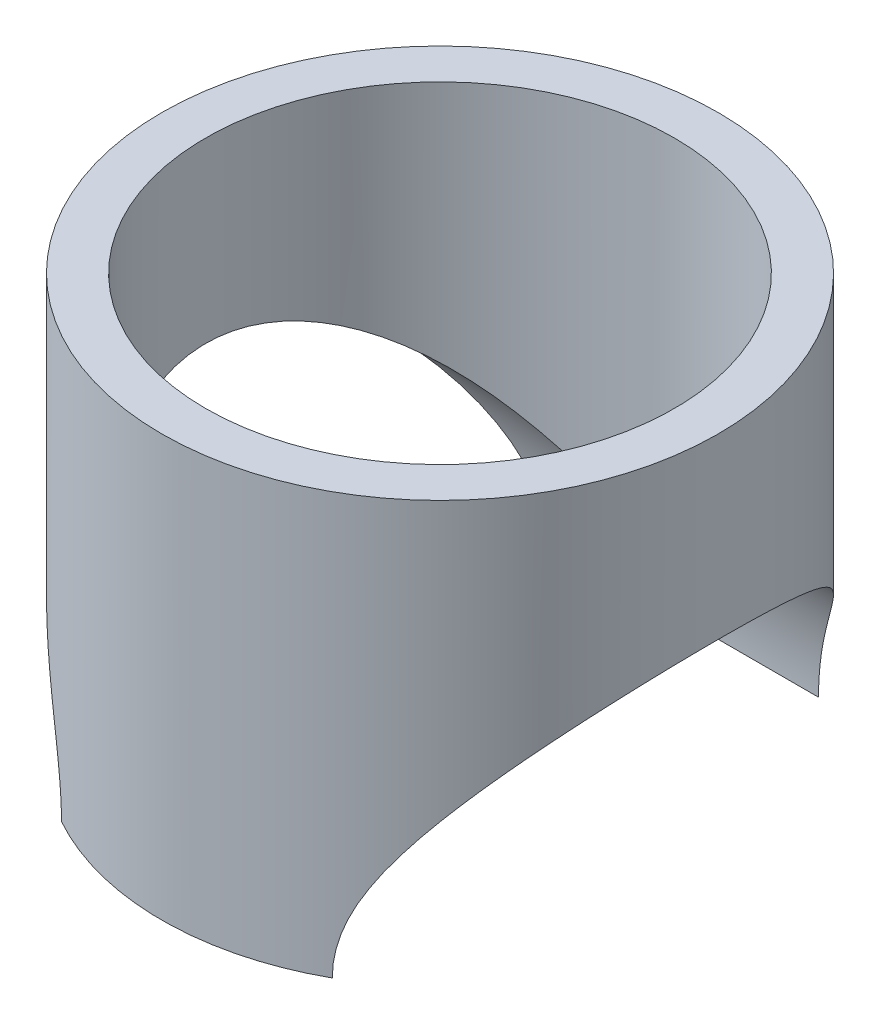
ISO-10303-21;
HEADER;
FILE_DESCRIPTION(('STEP AP214'),'2;1');
FILE_NAME('part.step','',(''),(''),'','','');
FILE_SCHEMA(('AUTOMOTIVE_DESIGN { 1 0 10303 214 1 1 1 1 }'));
ENDSEC;
DATA;
#1=APPLICATION_CONTEXT('core data for automotive mechanical design processes');
#2=APPLICATION_PROTOCOL_DEFINITION('international standard','automotive_design',2000,#1);
#3=PRODUCT_CONTEXT('',#1,'mechanical');
#4=PRODUCT('Part','Part','',(#3));
#5=PRODUCT_RELATED_PRODUCT_CATEGORY('part','',(#4));
#6=PRODUCT_DEFINITION_FORMATION('','',#4);
#7=PRODUCT_DEFINITION_CONTEXT('part definition',#1,'design');
#8=PRODUCT_DEFINITION('design','',#6,#7);
#9=PRODUCT_DEFINITION_SHAPE('','',#8);
#10=(LENGTH_UNIT() NAMED_UNIT(*) SI_UNIT(.MILLI.,.METRE.));
#11=(NAMED_UNIT(*) PLANE_ANGLE_UNIT() SI_UNIT($,.RADIAN.));
#12=(NAMED_UNIT(*) SI_UNIT($,.STERADIAN.) SOLID_ANGLE_UNIT());
#13=UNCERTAINTY_MEASURE_WITH_UNIT(LENGTH_MEASURE(1.E-05),#10,'distance_accuracy_value','');
#14=(GEOMETRIC_REPRESENTATION_CONTEXT(3) GLOBAL_UNCERTAINTY_ASSIGNED_CONTEXT((#13)) GLOBAL_UNIT_ASSIGNED_CONTEXT((#10,
#11,#12)) REPRESENTATION_CONTEXT('',''));
#15=CARTESIAN_POINT('',(0.,0.,0.));
#16=DIRECTION('',(0.,0.,1.));
#17=DIRECTION('',(1.,0.,0.));
#18=AXIS2_PLACEMENT_3D('',#15,#16,#17);
#19=CARTESIAN_POINT('',(0.,-18.25625,0.));
#20=DIRECTION('',(0.,1.,0.));
#21=DIRECTION('',(0.,0.,1.));
#22=AXIS2_PLACEMENT_3D('',#19,#20,#21);
#23=PLANE('',#22);
#24=CARTESIAN_POINT('',(0.,-18.25625,0.));
#25=DIRECTION('',(0.,1.,0.));
#26=DIRECTION('',(0.,0.,1.));
#27=AXIS2_PLACEMENT_3D('',#24,#25,#26);
#28=CIRCLE('',#27,24.13);
#29=CARTESIAN_POINT('',(11.739087528424,-18.25625,-21.082));
#30=VERTEX_POINT('',#29);
#31=CARTESIAN_POINT('',(-11.739087528424,-18.25625,-21.082));
#32=VERTEX_POINT('',#31);
#33=EDGE_CURVE('E55',#30,#32,#28,.T.);
#34=ORIENTED_EDGE('',*,*,#33,.F.);
#35=DIRECTION('',(1.,0.,0.));
#36=VECTOR('',#35,1.);
#37=CARTESIAN_POINT('',(0.,-18.25625,-21.082));
#38=LINE('',#37,#36);
#39=EDGE_CURVE('E68',#30,#32,#38,.F.);
#40=ORIENTED_EDGE('',*,*,#39,.T.);
#41=EDGE_LOOP('',(#34,#40));
#42=FACE_BOUND('',#41,.T.);
#43=ADVANCED_FACE('F34',(#42),#23,.F.);
#44=CARTESIAN_POINT('',(0.,18.25625,0.));
#45=DIRECTION('',(0.,1.,0.));
#46=DIRECTION('',(0.,0.,1.));
#47=AXIS2_PLACEMENT_3D('',#44,#45,#46);
#48=PLANE('',#47);
#49=CARTESIAN_POINT('',(0.,18.25625,0.));
#50=DIRECTION('',(0.,1.,0.));
#51=DIRECTION('',(0.,0.,1.));
#52=AXIS2_PLACEMENT_3D('',#49,#50,#51);
#53=CIRCLE('',#52,24.13);
#54=CARTESIAN_POINT('',(0.,18.25625,24.13));
#55=VERTEX_POINT('',#54);
#56=EDGE_CURVE('E48',#55,#55,#53,.T.);
#57=ORIENTED_EDGE('',*,*,#56,.T.);
#58=EDGE_LOOP('',(#57));
#59=FACE_BOUND('',#58,.T.);
#60=CARTESIAN_POINT('',(0.,18.25625,0.));
#61=DIRECTION('',(0.,1.,0.));
#62=DIRECTION('',(0.,0.,1.));
#63=AXIS2_PLACEMENT_3D('',#60,#61,#62);
#64=CIRCLE('',#63,20.32);
#65=CARTESIAN_POINT('',(0.,18.25625,20.32));
#66=VERTEX_POINT('',#65);
#67=EDGE_CURVE('E79',#66,#66,#64,.T.);
#68=ORIENTED_EDGE('',*,*,#67,.F.);
#69=EDGE_LOOP('',(#68));
#70=FACE_BOUND('',#69,.T.);
#71=ADVANCED_FACE('F104',(#59,#70),#48,.T.);
#72=DIRECTION('',(1.,0.,0.));
#73=VECTOR('',#72,1.);
#74=CARTESIAN_POINT('',(0.,-18.25625,21.082));
#75=LINE('',#74,#73);
#76=CARTESIAN_POINT('',(-11.739087528424,-18.25625,21.082));
#77=VERTEX_POINT('',#76);
#78=CARTESIAN_POINT('',(11.739087528424,-18.25625,21.082));
#79=VERTEX_POINT('',#78);
#80=EDGE_CURVE('E62',#77,#79,#75,.T.);
#81=ORIENTED_EDGE('',*,*,#80,.T.);
#82=EDGE_CURVE('E77',#77,#79,#28,.T.);
#83=ORIENTED_EDGE('',*,*,#82,.F.);
#84=EDGE_LOOP('',(#81,#83));
#85=FACE_BOUND('',#84,.T.);
#86=ADVANCED_FACE('F106',(#85),#23,.F.);
#87=CARTESIAN_POINT('',(0.,18.25625,0.));
#88=DIRECTION('',(0.,-1.,0.));
#89=DIRECTION('',(0.,0.,-1.));
#90=AXIS2_PLACEMENT_3D('',#87,#88,#89);
#91=CYLINDRICAL_SURFACE('',#90,24.13);
#92=ORIENTED_EDGE('',*,*,#56,.F.);
#93=EDGE_LOOP('',(#92));
#94=FACE_BOUND('',#93,.T.);
#95=ORIENTED_EDGE('',*,*,#82,.T.);
#96=CARTESIAN_POINT('',(11.739087528424,-18.25625,21.082));
#97=CARTESIAN_POINT('',(11.7390735991911,-18.08407407303,21.0820033956179));
#98=CARTESIAN_POINT('',(11.7428775245086,-17.9119284080734,21.0798900670036));
#99=CARTESIAN_POINT('',(11.7579884747208,-17.5680994761874,21.0714669377096));
#100=CARTESIAN_POINT('',(11.7692941595323,-17.3964161321697,21.0651578865359));
#101=CARTESIAN_POINT('',(11.8141910028188,-16.8834391279661,21.040034025855));
#102=CARTESIAN_POINT('',(11.8587633128905,-16.543341097433,21.0150221015338));
#103=CARTESIAN_POINT('',(11.9737048677594,-15.8750339752899,20.9497376890227));
#104=CARTESIAN_POINT('',(12.0436335160157,-15.5467212428461,20.909725468668));
#105=CARTESIAN_POINT('',(12.2060359880762,-14.8976845627344,20.8153404861012));
#106=CARTESIAN_POINT('',(12.2985245072683,-14.5769657116835,20.7609583614737));
#107=CARTESIAN_POINT('',(12.5484251271962,-13.8013732186979,20.6112485337628));
#108=CARTESIAN_POINT('',(12.7162968837642,-13.3513025005434,20.5085195345175));
#109=CARTESIAN_POINT('',(13.0814490845255,-12.4701267720358,20.2775553309992));
#110=CARTESIAN_POINT('',(13.2787435684613,-12.039030943883,20.14930794021));
#111=CARTESIAN_POINT('',(13.6961533726555,-11.1911359828143,19.8679700881986));
#112=CARTESIAN_POINT('',(13.9164644077948,-10.7745077303363,19.714659039238));
#113=CARTESIAN_POINT('',(14.3715808518282,-9.95861330201741,19.3853933315258));
#114=CARTESIAN_POINT('',(14.6063854155648,-9.55934611611482,19.2094399924607));
#115=CARTESIAN_POINT('',(15.0351878436054,-8.85888917974106,18.8747921840822));
#116=CARTESIAN_POINT('',(15.2274436243599,-8.55465866664908,18.7201903507985));
#117=CARTESIAN_POINT('',(15.615749993839,-7.95589421440815,18.3975278906171));
#118=CARTESIAN_POINT('',(15.8118009645401,-7.66136125943689,18.2294659035912));
#119=CARTESIAN_POINT('',(16.4031186599564,-6.79162031883522,17.7051357024082));
#120=CARTESIAN_POINT('',(16.8014559261532,-6.23042092901618,17.3287955231726));
#121=CARTESIAN_POINT('',(17.5935759198042,-5.14657597181105,16.5239648376673));
#122=CARTESIAN_POINT('',(17.9873679374965,-4.62383191492748,16.0956155727483));
#123=CARTESIAN_POINT('',(18.7620280565222,-3.61689060282745,15.1855208236601));
#124=CARTESIAN_POINT('',(19.142901838275,-3.13267627581971,14.7037992166734));
#125=CARTESIAN_POINT('',(19.7979937394125,-2.31259208230997,13.8033060115728));
#126=CARTESIAN_POINT('',(20.0766187768359,-1.96819152161001,13.3954826047861));
#127=CARTESIAN_POINT('',(20.6170322702882,-1.30655085934945,12.5478087141213));
#128=CARTESIAN_POINT('',(20.8788211700136,-0.989310041952961,12.1079590749085));
#129=CARTESIAN_POINT('',(21.3811440106904,-0.385177021028827,11.1970391769103));
#130=CARTESIAN_POINT('',(21.6217005084017,-0.0982525447157852,10.7260030044625));
#131=CARTESIAN_POINT('',(21.9634627085038,0.306959834283379,9.99676525436779));
#132=CARTESIAN_POINT('',(22.074200527265,0.437830046209029,9.7499160274075));
#133=CARTESIAN_POINT('',(22.2888283168124,0.690786093225204,9.24874897262869));
#134=CARTESIAN_POINT('',(22.3927165090234,0.812869647518544,8.99442922960148));
#135=CARTESIAN_POINT('',(22.6557598724382,1.12124272779861,8.31719373048579));
#136=CARTESIAN_POINT('',(22.8088160044349,1.29990149644173,7.88836839092437));
#137=CARTESIAN_POINT('',(23.0928338791217,1.63042748467382,7.01351531469732));
#138=CARTESIAN_POINT('',(23.2238001390804,1.78230018217138,6.56749111808858));
#139=CARTESIAN_POINT('',(23.4613695200211,2.05715593136349,5.66044959105592));
#140=CARTESIAN_POINT('',(23.5679822167315,2.1801503384237,5.19943823525703));
#141=CARTESIAN_POINT('',(23.7548637062547,2.39538979797867,4.26501387511208));
#142=CARTESIAN_POINT('',(23.8351322079308,2.48763451065056,3.791600733773));
#143=CARTESIAN_POINT('',(23.9680076717743,2.64017622817548,2.83315766499687));
#144=CARTESIAN_POINT('',(24.0204651423892,2.70030059076089,2.34807932105807));
#145=CARTESIAN_POINT('',(24.0958936412044,2.78671462776825,1.37262187745551));
#146=CARTESIAN_POINT('',(24.1188646023565,2.81300422525463,0.882242765741078));
#147=CARTESIAN_POINT('',(24.1347883831059,2.83123097137466,-0.0995719725427617));
#148=CARTESIAN_POINT('',(24.1277454676267,2.82317300074236,-0.59100743908707));
#149=CARTESIAN_POINT('',(24.0838129836678,2.77287321380192,-1.57075843632448));
#150=CARTESIAN_POINT('',(24.046924979396,2.730633189006,-2.05907412917589));
#151=CARTESIAN_POINT('',(23.9485083643139,2.61779042171497,-2.98747550538334));
#152=CARTESIAN_POINT('',(23.8893296033681,2.54989091094967,-3.42814511096225));
#153=CARTESIAN_POINT('',(23.7477698443778,2.38719943436388,-4.30065532684726));
#154=CARTESIAN_POINT('',(23.6653904470208,2.29240932381025,-4.73249654404878));
#155=CARTESIAN_POINT('',(23.4788321311074,2.07727528630051,-5.58495844876746));
#156=CARTESIAN_POINT('',(23.3746515218667,1.95692937748145,-6.00557826321081));
#157=CARTESIAN_POINT('',(23.1461387876345,1.69223427108215,-6.83356769686585));
#158=CARTESIAN_POINT('',(23.0218054185968,1.54788359165367,-7.24093649621643));
#159=CARTESIAN_POINT('',(22.7456021652489,1.2261398431218,-8.0683039057928));
#160=CARTESIAN_POINT('',(22.5924274017339,1.04715813372704,-8.48724779671844));
#161=CARTESIAN_POINT('',(22.2673789975177,0.665693744031697,-9.30672224437815));
#162=CARTESIAN_POINT('',(22.0955050238618,0.463210645265515,-9.70725247306132));
#163=CARTESIAN_POINT('',(21.7352637750987,0.0366060825356913,-10.4890666599843));
#164=CARTESIAN_POINT('',(21.5468908942153,-0.187522738595435,-10.8703440068291));
#165=CARTESIAN_POINT('',(21.1559090574181,-0.655600764159128,-11.6129492644716));
#166=CARTESIAN_POINT('',(20.9532971606271,-0.899554064707212,-11.9742730264431));
#167=CARTESIAN_POINT('',(20.4283285028445,-1.53627061071713,-12.857822369502));
#168=CARTESIAN_POINT('',(20.0981131136747,-1.94088524276709,-13.3669087963575));
#169=CARTESIAN_POINT('',(19.4171168179919,-2.78751979392966,-14.3382207585271));
#170=CARTESIAN_POINT('',(19.0663264434196,-3.22955697604914,-14.8004244483688));
#171=CARTESIAN_POINT('',(18.3504579632687,-4.14892420714467,-15.6792711924517));
#172=CARTESIAN_POINT('',(17.9853453799674,-4.62634223806346,-16.0957938142865));
#173=CARTESIAN_POINT('',(17.2492225520943,-5.6135470593565,-16.882271969802));
#174=CARTESIAN_POINT('',(16.878213912849,-6.1233251484868,-17.2522399423612));
#175=CARTESIAN_POINT('',(16.1928125714475,-7.0981656749566,-17.8951682454679));
#176=CARTESIAN_POINT('',(15.878076524012,-7.55886167034416,-18.1744024144448));
#177=CARTESIAN_POINT('',(15.256825362399,-8.5047407678277,-18.698968527221));
#178=CARTESIAN_POINT('',(14.9503124668056,-8.98993037848372,-18.944291394521));
#179=CARTESIAN_POINT('',(14.3546359423477,-9.98531509123404,-19.3995164604927));
#180=CARTESIAN_POINT('',(14.065432574079,-10.495447614902,-19.6095019682124));
#181=CARTESIAN_POINT('',(13.6529179816347,-11.2816261140679,-19.8968072202025));
#182=CARTESIAN_POINT('',(13.5190022183166,-11.5470911566672,-19.9879379518083));
#183=CARTESIAN_POINT('',(13.2600944866233,-12.0853732702324,-20.1606308855133));
#184=CARTESIAN_POINT('',(13.1351041264938,-12.3581916540404,-20.2421913648677));
#185=CARTESIAN_POINT('',(12.747458743117,-13.2557469080203,-20.490487427798));
#186=CARTESIAN_POINT('',(12.5067493342205,-13.8965014440883,-20.6371170384919));
#187=CARTESIAN_POINT('',(12.2101050282709,-14.8830900866602,-20.8130643312883));
#188=CARTESIAN_POINT('',(12.1220620285236,-15.2155691231136,-20.8643271503547));
#189=CARTESIAN_POINT('',(11.9710882109104,-15.888124681314,-20.9513124087923));
#190=CARTESIAN_POINT('',(11.9081413380531,-16.2281961983066,-20.9870447849298));
#191=CARTESIAN_POINT('',(11.8199438741503,-16.8489697363104,-21.0368249538532));
#192=CARTESIAN_POINT('',(11.7898196611475,-17.1287570685328,-21.0536932955336));
#193=CARTESIAN_POINT('',(11.7492929221813,-17.6910754620512,-21.0763171033168));
#194=CARTESIAN_POINT('',(11.7389525984072,-17.9736123790282,-21.0820375204629));
#195=CARTESIAN_POINT('',(11.739087528424,-18.25625,-21.082));
#196=B_SPLINE_CURVE_WITH_KNOTS('',3,(#96,#97,#98,#99,#100,#101,#102,#103,#104,#105,#106,#107,
#108,#109,#110,#111,#112,#113,#114,#115,#116,#117,#118,#119,#120,#121,#122,#123,#124,#125,#126,
#127,#128,#129,#130,#131,#132,#133,#134,#135,#136,#137,#138,#139,#140,#141,#142,#143,#144,#145,
#146,#147,#148,#149,#150,#151,#152,#153,#154,#155,#156,#157,#158,#159,#160,#161,#162,#163,#164,
#165,#166,#167,#168,#169,#170,#171,#172,#173,#174,#175,#176,#177,#178,#179,#180,#181,#182,#183,
#184,#185,#186,#187,#188,#189,#190,#191,#192,#193,#194,#195),.UNSPECIFIED.,.F.,.F.,(4,2,2,2,2,2,
2,2,2,2,2,2,2,2,2,2,2,2,2,2,2,2,2,2,2,2,2,2,2,2,2,2,2,2,2,2,2,2,2,2,2,2,2,2,2,2,2,2,2,4),(0.,
0.516414774766779,1.03273732417139,2.06276206676861,3.07568518591108,4.08926988849761,
5.56045256298501,7.03233950631079,8.51795690508985,10.0034877551208,11.1781755276448,
12.3529821507218,14.7031691082531,17.0471107031818,19.390007891152,21.1948722669283,
22.9996890581353,24.802564780825,25.7039285991681,26.6055255514872,28.071339885437,
29.5368541032964,31.0017910908485,32.4667442672644,33.9394940960529,35.4122472736656,
36.8847911824043,38.3572579187905,39.7050947911592,41.0528386946392,42.4006871544234,
43.7486188496975,45.1891451440145,46.6296970922703,48.0707404047464,49.5120822250155,
51.6968835037557,53.8826981801523,56.0741435666265,58.2650021746245,60.1353967072175,
62.0062908932544,63.8727106398916,64.8053050988661,65.7380671778323,67.829964425309,
68.8721351756851,69.9136381339799,70.7584804344512,71.6059746520517),.UNSPECIFIED.);
#197=EDGE_CURVE('E71',#79,#30,#196,.T.);
#198=ORIENTED_EDGE('',*,*,#197,.T.);
#199=ORIENTED_EDGE('',*,*,#33,.T.);
#200=CARTESIAN_POINT('',(-11.739087528424,-18.25625,-21.082));
#201=CARTESIAN_POINT('',(-11.7390735991911,-18.08407407303,-21.0820033956179));
#202=CARTESIAN_POINT('',(-11.7428775245086,-17.9119284080734,-21.0798900670036));
#203=CARTESIAN_POINT('',(-11.7579884747208,-17.5680994761874,-21.0714669377096));
#204=CARTESIAN_POINT('',(-11.7692941595323,-17.3964161321697,-21.0651578865359));
#205=CARTESIAN_POINT('',(-11.8141910028188,-16.8834391279661,-21.040034025855));
#206=CARTESIAN_POINT('',(-11.8587633128905,-16.543341097433,-21.0150221015338));
#207=CARTESIAN_POINT('',(-11.9737048677594,-15.8750339752899,-20.9497376890227));
#208=CARTESIAN_POINT('',(-12.0436335160157,-15.5467212428461,-20.909725468668));
#209=CARTESIAN_POINT('',(-12.2060359880762,-14.8976845627344,-20.8153404861012));
#210=CARTESIAN_POINT('',(-12.2985245072683,-14.5769657116835,-20.7609583614737));
#211=CARTESIAN_POINT('',(-12.5484251271962,-13.8013732186979,-20.6112485337628));
#212=CARTESIAN_POINT('',(-12.7162968837642,-13.3513025005434,-20.5085195345175));
#213=CARTESIAN_POINT('',(-13.0814490845255,-12.4701267720358,-20.2775553309992));
#214=CARTESIAN_POINT('',(-13.2787435684613,-12.039030943883,-20.14930794021));
#215=CARTESIAN_POINT('',(-13.6961533726555,-11.1911359828143,-19.8679700881986));
#216=CARTESIAN_POINT('',(-13.9164644077948,-10.7745077303363,-19.714659039238));
#217=CARTESIAN_POINT('',(-14.3715808518282,-9.95861330201741,-19.3853933315258));
#218=CARTESIAN_POINT('',(-14.6063854155648,-9.55934611611482,-19.2094399924607));
#219=CARTESIAN_POINT('',(-15.0351878436054,-8.85888917974106,-18.8747921840822));
#220=CARTESIAN_POINT('',(-15.2274436243599,-8.55465866664908,-18.7201903507985));
#221=CARTESIAN_POINT('',(-15.615749993839,-7.95589421440815,-18.3975278906171));
#222=CARTESIAN_POINT('',(-15.8118009645401,-7.66136125943689,-18.2294659035912));
#223=CARTESIAN_POINT('',(-16.4031186599564,-6.79162031883522,-17.7051357024082));
#224=CARTESIAN_POINT('',(-16.8014559261532,-6.23042092901618,-17.3287955231726));
#225=CARTESIAN_POINT('',(-17.5935759198042,-5.14657597181105,-16.5239648376673));
#226=CARTESIAN_POINT('',(-17.9873679374965,-4.62383191492748,-16.0956155727483));
#227=CARTESIAN_POINT('',(-18.7620280565222,-3.61689060282745,-15.1855208236601));
#228=CARTESIAN_POINT('',(-19.142901838275,-3.13267627581971,-14.7037992166734));
#229=CARTESIAN_POINT('',(-19.7979937394125,-2.31259208230997,-13.8033060115728));
#230=CARTESIAN_POINT('',(-20.0766187768359,-1.96819152161001,-13.3954826047861));
#231=CARTESIAN_POINT('',(-20.6170322702882,-1.30655085934945,-12.5478087141213));
#232=CARTESIAN_POINT('',(-20.8788211700136,-0.989310041952961,-12.1079590749085));
#233=CARTESIAN_POINT('',(-21.3811440106904,-0.385177021028827,-11.1970391769103));
#234=CARTESIAN_POINT('',(-21.6217005084017,-0.0982525447157852,-10.7260030044625));
#235=CARTESIAN_POINT('',(-21.9634627085038,0.306959834283379,-9.99676525436779));
#236=CARTESIAN_POINT('',(-22.074200527265,0.437830046209029,-9.7499160274075));
#237=CARTESIAN_POINT('',(-22.2888283168124,0.690786093225204,-9.24874897262869));
#238=CARTESIAN_POINT('',(-22.3927165090234,0.812869647518544,-8.99442922960148));
#239=CARTESIAN_POINT('',(-22.6557598724382,1.12124272779861,-8.31719373048579));
#240=CARTESIAN_POINT('',(-22.8088160044349,1.29990149644173,-7.88836839092437));
#241=CARTESIAN_POINT('',(-23.0928338791217,1.63042748467382,-7.01351531469732));
#242=CARTESIAN_POINT('',(-23.2238001390804,1.78230018217138,-6.56749111808858));
#243=CARTESIAN_POINT('',(-23.4613695200211,2.05715593136349,-5.66044959105592));
#244=CARTESIAN_POINT('',(-23.5679822167315,2.1801503384237,-5.19943823525703));
#245=CARTESIAN_POINT('',(-23.7548637062547,2.39538979797867,-4.26501387511208));
#246=CARTESIAN_POINT('',(-23.8351322079308,2.48763451065056,-3.791600733773));
#247=CARTESIAN_POINT('',(-23.9680076717743,2.64017622817548,-2.83315766499687));
#248=CARTESIAN_POINT('',(-24.0204651423892,2.70030059076089,-2.34807932105807));
#249=CARTESIAN_POINT('',(-24.0958936412044,2.78671462776825,-1.37262187745551));
#250=CARTESIAN_POINT('',(-24.1188646023565,2.81300422525463,-0.882242765741078));
#251=CARTESIAN_POINT('',(-24.1347883831059,2.83123097137466,0.0995719725427617));
#252=CARTESIAN_POINT('',(-24.1277454676267,2.82317300074236,0.59100743908707));
#253=CARTESIAN_POINT('',(-24.0838129836678,2.77287321380192,1.57075843632448));
#254=CARTESIAN_POINT('',(-24.046924979396,2.730633189006,2.05907412917589));
#255=CARTESIAN_POINT('',(-23.9485083643139,2.61779042171497,2.98747550538334));
#256=CARTESIAN_POINT('',(-23.8893296033681,2.54989091094967,3.42814511096225));
#257=CARTESIAN_POINT('',(-23.7477698443778,2.38719943436388,4.30065532684726));
#258=CARTESIAN_POINT('',(-23.6653904470208,2.29240932381025,4.73249654404878));
#259=CARTESIAN_POINT('',(-23.4788321311074,2.07727528630051,5.58495844876746));
#260=CARTESIAN_POINT('',(-23.3746515218667,1.95692937748145,6.00557826321081));
#261=CARTESIAN_POINT('',(-23.1461387876345,1.69223427108215,6.83356769686585));
#262=CARTESIAN_POINT('',(-23.0218054185968,1.54788359165367,7.24093649621643));
#263=CARTESIAN_POINT('',(-22.7456021652489,1.2261398431218,8.0683039057928));
#264=CARTESIAN_POINT('',(-22.5924274017339,1.04715813372704,8.48724779671844));
#265=CARTESIAN_POINT('',(-22.2673789975177,0.665693744031697,9.30672224437815));
#266=CARTESIAN_POINT('',(-22.0955050238618,0.463210645265515,9.70725247306132));
#267=CARTESIAN_POINT('',(-21.7352637750987,0.0366060825356913,10.4890666599843));
#268=CARTESIAN_POINT('',(-21.5468908942153,-0.187522738595435,10.8703440068291));
#269=CARTESIAN_POINT('',(-21.1559090574181,-0.655600764159128,11.6129492644716));
#270=CARTESIAN_POINT('',(-20.9532971606271,-0.899554064707212,11.9742730264431));
#271=CARTESIAN_POINT('',(-20.4283285028445,-1.53627061071713,12.857822369502));
#272=CARTESIAN_POINT('',(-20.0981131136747,-1.94088524276709,13.3669087963575));
#273=CARTESIAN_POINT('',(-19.4171168179919,-2.78751979392966,14.3382207585271));
#274=CARTESIAN_POINT('',(-19.0663264434196,-3.22955697604914,14.8004244483688));
#275=CARTESIAN_POINT('',(-18.3504579632687,-4.14892420714467,15.6792711924517));
#276=CARTESIAN_POINT('',(-17.9853453799674,-4.62634223806346,16.0957938142865));
#277=CARTESIAN_POINT('',(-17.2492225520943,-5.6135470593565,16.882271969802));
#278=CARTESIAN_POINT('',(-16.878213912849,-6.1233251484868,17.2522399423612));
#279=CARTESIAN_POINT('',(-16.1928125714475,-7.0981656749566,17.8951682454679));
#280=CARTESIAN_POINT('',(-15.878076524012,-7.55886167034416,18.1744024144448));
#281=CARTESIAN_POINT('',(-15.256825362399,-8.5047407678277,18.698968527221));
#282=CARTESIAN_POINT('',(-14.9503124668056,-8.98993037848372,18.944291394521));
#283=CARTESIAN_POINT('',(-14.3546359423477,-9.98531509123404,19.3995164604927));
#284=CARTESIAN_POINT('',(-14.065432574079,-10.495447614902,19.6095019682124));
#285=CARTESIAN_POINT('',(-13.6529179816347,-11.2816261140679,19.8968072202025));
#286=CARTESIAN_POINT('',(-13.5190022183166,-11.5470911566672,19.9879379518083));
#287=CARTESIAN_POINT('',(-13.2600944866233,-12.0853732702324,20.1606308855133));
#288=CARTESIAN_POINT('',(-13.1351041264938,-12.3581916540404,20.2421913648677));
#289=CARTESIAN_POINT('',(-12.747458743117,-13.2557469080203,20.490487427798));
#290=CARTESIAN_POINT('',(-12.5067493342205,-13.8965014440883,20.6371170384919));
#291=CARTESIAN_POINT('',(-12.2101050282709,-14.8830900866602,20.8130643312883));
#292=CARTESIAN_POINT('',(-12.1220620285236,-15.2155691231136,20.8643271503547));
#293=CARTESIAN_POINT('',(-11.9710882109104,-15.888124681314,20.9513124087923));
#294=CARTESIAN_POINT('',(-11.9081413380531,-16.2281961983066,20.9870447849298));
#295=CARTESIAN_POINT('',(-11.8199438741503,-16.8489697363104,21.0368249538532));
#296=CARTESIAN_POINT('',(-11.7898196611475,-17.1287570685328,21.0536932955336));
#297=CARTESIAN_POINT('',(-11.7492929221813,-17.6910754620512,21.0763171033168));
#298=CARTESIAN_POINT('',(-11.7389525984072,-17.9736123790282,21.0820375204629));
#299=CARTESIAN_POINT('',(-11.739087528424,-18.25625,21.082));
#300=B_SPLINE_CURVE_WITH_KNOTS('',3,(#200,#201,#202,#203,#204,#205,#206,#207,#208,#209,#210,
#211,#212,#213,#214,#215,#216,#217,#218,#219,#220,#221,#222,#223,#224,#225,#226,#227,#228,#229,
#230,#231,#232,#233,#234,#235,#236,#237,#238,#239,#240,#241,#242,#243,#244,#245,#246,#247,#248,
#249,#250,#251,#252,#253,#254,#255,#256,#257,#258,#259,#260,#261,#262,#263,#264,#265,#266,#267,
#268,#269,#270,#271,#272,#273,#274,#275,#276,#277,#278,#279,#280,#281,#282,#283,#284,#285,#286,
#287,#288,#289,#290,#291,#292,#293,#294,#295,#296,#297,#298,#299),.UNSPECIFIED.,.F.,.F.,(4,2,2,
2,2,2,2,2,2,2,2,2,2,2,2,2,2,2,2,2,2,2,2,2,2,2,2,2,2,2,2,2,2,2,2,2,2,2,2,2,2,2,2,2,2,2,2,2,2,4),
(0.,0.516414774766779,1.03273732417139,2.06276206676861,3.07568518591108,4.08926988849761,
5.56045256298501,7.03233950631079,8.51795690508985,10.0034877551208,11.1781755276448,
12.3529821507218,14.7031691082531,17.0471107031818,19.390007891152,21.1948722669283,
22.9996890581353,24.802564780825,25.7039285991681,26.6055255514872,28.071339885437,
29.5368541032964,31.0017910908485,32.4667442672644,33.9394940960529,35.4122472736656,
36.8847911824043,38.3572579187905,39.7050947911592,41.0528386946392,42.4006871544234,
43.7486188496975,45.1891451440145,46.6296970922703,48.0707404047464,49.5120822250155,
51.6968835037557,53.8826981801523,56.0741435666265,58.2650021746245,60.1353967072175,
62.0062908932544,63.8727106398916,64.8053050988661,65.7380671778323,67.829964425309,
68.8721351756851,69.9136381339799,70.7584804344512,71.6059746520517),.UNSPECIFIED.);
#301=EDGE_CURVE('E72',#32,#77,#300,.T.);
#302=ORIENTED_EDGE('',*,*,#301,.T.);
#303=EDGE_LOOP('',(#95,#198,#199,#302));
#304=FACE_BOUND('',#303,.T.);
#305=ADVANCED_FACE('F36',(#94,#304),#91,.T.);
#306=CARTESIAN_POINT('',(0.,18.25625,0.));
#307=DIRECTION('',(0.,-1.,0.));
#308=DIRECTION('',(0.,0.,-1.));
#309=AXIS2_PLACEMENT_3D('',#306,#307,#308);
#310=CYLINDRICAL_SURFACE('',#309,20.32);
#311=CARTESIAN_POINT('',(0.,-12.6394605255761,-20.32));
#312=CARTESIAN_POINT('',(-0.184417417974767,-12.6394619019347,-20.3200002606694));
#313=CARTESIAN_POINT('',(-0.368829240780096,-12.6303181397513,-20.3174797464156));
#314=CARTESIAN_POINT('',(-0.735755044605389,-12.5944273212818,-20.3075063282795));
#315=CARTESIAN_POINT('',(-0.918268849772865,-12.567678648393,-20.3000529714296));
#316=CARTESIAN_POINT('',(-1.46211042045118,-12.4631860121443,-20.2705809180041));
#317=CARTESIAN_POINT('',(-1.81847995875847,-12.3612134345082,-20.2414528663234));
#318=CARTESIAN_POINT('',(-2.44969099295465,-12.1343174735069,-20.1738410029329));
#319=CARTESIAN_POINT('',(-2.72768518212068,-12.016798410833,-20.1379747535897));
#320=CARTESIAN_POINT('',(-3.27228928450342,-11.7602004245639,-20.0566754646791));
#321=CARTESIAN_POINT('',(-3.53888863748094,-11.6211020320621,-20.0112337727357));
#322=CARTESIAN_POINT('',(-4.06279408315517,-11.3275166888492,-19.9114918481958));
#323=CARTESIAN_POINT('',(-4.32006606467843,-11.1729797646717,-19.857162459618));
#324=CARTESIAN_POINT('',(-4.82598863281761,-10.8535403759254,-19.7403031602825));
#325=CARTESIAN_POINT('',(-5.07464190207152,-10.6886411824688,-19.6777758307078));
#326=CARTESIAN_POINT('',(-5.61110777913172,-10.3197499393006,-19.532256912199));
#327=CARTESIAN_POINT('',(-5.89744038342538,-10.1142592694743,-19.4476310577278));
#328=CARTESIAN_POINT('',(-6.46176543144866,-9.69664606176831,-19.2674775135538));
#329=CARTESIAN_POINT('',(-6.73975609042764,-9.48452212425399,-19.1719475116272));
#330=CARTESIAN_POINT('',(-7.28874849223839,-9.05599309878468,-18.9700327622342));
#331=CARTESIAN_POINT('',(-7.55974488755073,-8.83958494634641,-18.8636400005617));
#332=CARTESIAN_POINT('',(-8.09533824154419,-8.4044194245839,-18.6400661126524));
#333=CARTESIAN_POINT('',(-8.35993461073448,-8.1856618415188,-18.5228839973764));
#334=CARTESIAN_POINT('',(-9.14485614510763,-7.52804124389511,-18.1551158882365));
#335=CARTESIAN_POINT('',(-9.65645512101587,-7.08771797988564,-17.8882559386435));
#336=CARTESIAN_POINT('',(-10.6576028478083,-6.21154772164822,-17.3104464394853));
#337=CARTESIAN_POINT('',(-11.1471607536951,-5.77569892806979,-16.9995154221488));
#338=CARTESIAN_POINT('',(-12.093164403356,-4.9238976111927,-16.3396066952305));
#339=CARTESIAN_POINT('',(-12.5501073158894,-4.50771807067916,-15.9916423689944));
#340=CARTESIAN_POINT('',(-13.2178553114513,-3.89476240752689,-15.4361420262537));
#341=CARTESIAN_POINT('',(-13.4375126804218,-3.69231163272043,-15.245364132466));
#342=CARTESIAN_POINT('',(-13.8706609222317,-3.2917335905789,-14.8523642620018));
#343=CARTESIAN_POINT('',(-14.0841494168222,-3.09360799771644,-14.6501379583033));
#344=CARTESIAN_POINT('',(-14.7139003784012,-2.50748571774826,-14.0268355897561));
#345=CARTESIAN_POINT('',(-15.120266213253,-2.12699067858719,-13.5884593320207));
#346=CARTESIAN_POINT('',(-15.9018875749204,-1.3920657060148,-12.6648371183912));
#347=CARTESIAN_POINT('',(-16.2771559847739,-1.03762498576567,-12.1796107537675));
#348=CARTESIAN_POINT('',(-16.8934596093329,-0.453709469179471,-11.3012065318532));
#349=CARTESIAN_POINT('',(-17.1431331110622,-0.216572919605269,-10.9191581442352));
#350=CARTESIAN_POINT('',(-17.6207243318259,0.237880280873775,-10.1303980434832));
#351=CARTESIAN_POINT('',(-17.8486437164111,0.455198449067648,-9.7236882223967));
#352=CARTESIAN_POINT('',(-18.2797572549343,0.86687109700068,-8.88674550324429));
#353=CARTESIAN_POINT('',(-18.4829740288266,1.06124658034271,-8.4565346562131));
#354=CARTESIAN_POINT('',(-18.8619396668621,1.42414919543712,-7.57365626895639));
#355=CARTESIAN_POINT('',(-19.0376925267468,1.59268008726829,-7.12099200814045));
#356=CARTESIAN_POINT('',(-19.3342040014815,1.87726219254343,-6.26604364988622));
#357=CARTESIAN_POINT('',(-19.4592619306066,1.9973971947559,-5.8666066613227));
#358=CARTESIAN_POINT('',(-19.6856896244314,2.21504022995331,-5.05504009024362));
#359=CARTESIAN_POINT('',(-19.7870616883833,2.31255045918105,-4.64291174411265));
#360=CARTESIAN_POINT('',(-19.9644670104148,2.48326988849953,-3.80845301074774));
#361=CARTESIAN_POINT('',(-20.0405108931257,2.55648927802772,-3.38612698116023));
#362=CARTESIAN_POINT('',(-20.1659928441528,2.67734276175507,-2.53389474380582));
#363=CARTESIAN_POINT('',(-20.2154306244937,2.72497657902467,-2.10398845404477));
#364=CARTESIAN_POINT('',(-20.2868960424269,2.79384223719538,-1.23833656851701));
#365=CARTESIAN_POINT('',(-20.3088318841162,2.81498565835861,-0.80257629806259));
#366=CARTESIAN_POINT('',(-20.3245635654344,2.83014854660544,0.0699275142370868));
#367=CARTESIAN_POINT('',(-20.3183593707468,2.82416798061169,0.506671057280781));
#368=CARTESIAN_POINT('',(-20.2779320096456,2.78520483913035,1.37766601124881));
#369=CARTESIAN_POINT('',(-20.2437070672037,2.75222055207639,1.81191726244824));
#370=CARTESIAN_POINT('',(-20.1478925100936,2.65990958836411,2.67453830819819));
#371=CARTESIAN_POINT('',(-20.0863032366482,2.60058324018128,3.10290817601866));
#372=CARTESIAN_POINT('',(-19.9406604621129,2.46035921734366,3.92932071023734));
#373=CARTESIAN_POINT('',(-19.8578962132195,2.38070002068302,4.32780346663534));
#374=CARTESIAN_POINT('',(-19.6699877997052,2.19994917159982,5.11444125906626));
#375=CARTESIAN_POINT('',(-19.5648450605255,2.09885888427351,5.50259695113068));
#376=CARTESIAN_POINT('',(-19.3336199945227,1.87671194699303,6.26681324533769));
#377=CARTESIAN_POINT('',(-19.2075340887837,1.7556518844871,6.64287176709703));
#378=CARTESIAN_POINT('',(-18.9359949259391,1.49517420498538,7.38142123941378));
#379=CARTESIAN_POINT('',(-18.7905377766887,1.35575289884044,7.74390944457042));
#380=CARTESIAN_POINT('',(-18.4230128636173,1.00386247103155,8.58958277244538));
#381=CARTESIAN_POINT('',(-18.1928721065152,0.783801584866496,9.0661299740245));
#382=CARTESIAN_POINT('',(-17.7027608366545,0.316060218004689,9.98939772110448));
#383=CARTESIAN_POINT('',(-17.4427811194754,0.0683712155328585,10.4361089955357));
#384=CARTESIAN_POINT('',(-16.8962961510647,-0.451028651050392,11.2995155173916));
#385=CARTESIAN_POINT('',(-16.6097456135166,-0.722780490079615,11.7161572842663));
#386=CARTESIAN_POINT('',(-16.0138409648839,-1.28621682917446,12.5183470177444));
#387=CARTESIAN_POINT('',(-15.7044864294472,-1.57790170015999,12.9038944054429));
#388=CARTESIAN_POINT('',(-14.9498648705224,-2.28676661456996,13.7785312387024));
#389=CARTESIAN_POINT('',(-14.4960020034565,-2.71108870676215,14.2544489125096));
#390=CARTESIAN_POINT('',(-13.5566859501954,-3.58309569953304,15.1505897511677));
#391=CARTESIAN_POINT('',(-13.071218887872,-4.03079084495821,15.5707882026938));
#392=CARTESIAN_POINT('',(-12.0723701419288,-4.94276645247577,16.3574051526222));
#393=CARTESIAN_POINT('',(-11.5589684814955,-5.4070587000227,16.7237844519108));
#394=CARTESIAN_POINT('',(-10.5068124086764,-6.34474698990341,17.4040767989496));
#395=CARTESIAN_POINT('',(-9.96806710485529,-6.81813972587044,17.7180085146238));
#396=CARTESIAN_POINT('',(-9.05744475815976,-7.60016768141796,18.1942032056478));
#397=CARTESIAN_POINT('',(-8.69299174241924,-7.90861082702446,18.371148039684));
#398=CARTESIAN_POINT('',(-7.95212427970901,-8.5227242824924,18.7037722251653));
#399=CARTESIAN_POINT('',(-7.57570847144346,-8.8283942716606,18.8594491456886));
#400=CARTESIAN_POINT('',(-6.80970423852603,-9.43216347574923,19.1493590573222));
#401=CARTESIAN_POINT('',(-6.4201367484271,-9.73027351174013,19.283624345782));
#402=CARTESIAN_POINT('',(-5.8231456028714,-10.1668018999906,19.4688636232259));
#403=CARTESIAN_POINT('',(-5.62207575387877,-10.3105159944147,19.5279086199211));
#404=CARTESIAN_POINT('',(-5.21507376451691,-10.5931049390919,19.6405198693077));
#405=CARTESIAN_POINT('',(-5.00914222582211,-10.7319803829559,19.694086795626));
#406=CARTESIAN_POINT('',(-4.60007486105584,-10.9977490101039,19.7935394049732));
#407=CARTESIAN_POINT('',(-4.39716142567918,-11.1248995666483,19.839647792221));
#408=CARTESIAN_POINT('',(-3.98541381802482,-11.3711506774771,19.9264436965042));
#409=CARTESIAN_POINT('',(-3.77658104835329,-11.4902531165262,19.9671324849221));
#410=CARTESIAN_POINT('',(-3.35203381973312,-11.7177196112121,20.0427719146334));
#411=CARTESIAN_POINT('',(-3.13631930198481,-11.8260835750637,20.0777225068823));
#412=CARTESIAN_POINT('',(-2.69744123301836,-12.0283732060862,20.1413878508368));
#413=CARTESIAN_POINT('',(-2.47427974006974,-12.1223028231898,20.1701043093926));
#414=CARTESIAN_POINT('',(-1.88793259677985,-12.3399755236353,20.2353128883276));
#415=CARTESIAN_POINT('',(-1.51841644557882,-12.4495378430395,20.266695122651));
#416=CARTESIAN_POINT('',(-0.953897457208559,-12.5620215000821,20.298472438678));
#417=CARTESIAN_POINT('',(-0.764389465225233,-12.5908667920678,20.3065146725284));
#418=CARTESIAN_POINT('',(-0.383252049691645,-12.6295839249008,20.3172778508392));
#419=CARTESIAN_POINT('',(-0.191623004374876,-12.6394590954402,20.3199997291457));
#420=CARTESIAN_POINT('',(0.184417417974766,-12.6394619019347,20.3200002606694));
#421=CARTESIAN_POINT('',(0.368829240780097,-12.6303181397513,20.3174797464156));
#422=CARTESIAN_POINT('',(0.735755044605392,-12.5944273212818,20.3075063282795));
#423=CARTESIAN_POINT('',(0.91826884977287,-12.567678648393,20.3000529714296));
#424=CARTESIAN_POINT('',(1.46211042045118,-12.4631860121443,20.2705809180041));
#425=CARTESIAN_POINT('',(1.81847995875847,-12.3612134345082,20.2414528663234));
#426=CARTESIAN_POINT('',(2.44969099295465,-12.1343174735069,20.1738410029329));
#427=CARTESIAN_POINT('',(2.72768518212068,-12.016798410833,20.1379747535897));
#428=CARTESIAN_POINT('',(3.27228928450342,-11.7602004245639,20.0566754646791));
#429=CARTESIAN_POINT('',(3.53888863748095,-11.6211020320621,20.0112337727357));
#430=CARTESIAN_POINT('',(4.06279408315517,-11.3275166888492,19.9114918481958));
#431=CARTESIAN_POINT('',(4.32006606467843,-11.1729797646717,19.857162459618));
#432=CARTESIAN_POINT('',(4.82598863281761,-10.8535403759254,19.7403031602825));
#433=CARTESIAN_POINT('',(5.07464190207153,-10.6886411824688,19.6777758307078));
#434=CARTESIAN_POINT('',(5.61110777913172,-10.3197499393006,19.532256912199));
#435=CARTESIAN_POINT('',(5.89744038342538,-10.1142592694743,19.4476310577278));
#436=CARTESIAN_POINT('',(6.46176543144866,-9.69664606176831,19.2674775135538));
#437=CARTESIAN_POINT('',(6.73975609042764,-9.48452212425399,19.1719475116272));
#438=CARTESIAN_POINT('',(7.2887484922384,-9.05599309878468,18.9700327622342));
#439=CARTESIAN_POINT('',(7.55974488755074,-8.83958494634641,18.8636400005617));
#440=CARTESIAN_POINT('',(8.0953382415442,-8.4044194245839,18.6400661126524));
#441=CARTESIAN_POINT('',(8.35993461073449,-8.1856618415188,18.5228839973764));
#442=CARTESIAN_POINT('',(9.14485614510764,-7.52804124389511,18.1551158882364));
#443=CARTESIAN_POINT('',(9.65645512101587,-7.08771797988563,17.8882559386435));
#444=CARTESIAN_POINT('',(10.6576028478083,-6.21154772164821,17.3104464394853));
#445=CARTESIAN_POINT('',(11.1471607536951,-5.77569892806979,16.9995154221488));
#446=CARTESIAN_POINT('',(12.093164403356,-4.9238976111927,16.3396066952305));
#447=CARTESIAN_POINT('',(12.5501073158894,-4.50771807067916,15.9916423689944));
#448=CARTESIAN_POINT('',(13.2178553114513,-3.8947624075269,15.4361420262537));
#449=CARTESIAN_POINT('',(13.4375126804218,-3.69231163272043,15.245364132466));
#450=CARTESIAN_POINT('',(13.8706609222317,-3.29173359057891,14.8523642620018));
#451=CARTESIAN_POINT('',(14.0841494168222,-3.09360799771644,14.6501379583033));
#452=CARTESIAN_POINT('',(14.7139003784012,-2.50748571774826,14.0268355897561));
#453=CARTESIAN_POINT('',(15.120266213253,-2.12699067858719,13.5884593320207));
#454=CARTESIAN_POINT('',(15.9018875749204,-1.3920657060148,12.6648371183912));
#455=CARTESIAN_POINT('',(16.2771559847739,-1.03762498576567,12.1796107537675));
#456=CARTESIAN_POINT('',(16.8934596093329,-0.453709469179471,11.3012065318532));
#457=CARTESIAN_POINT('',(17.1431331110622,-0.216572919605268,10.9191581442352));
#458=CARTESIAN_POINT('',(17.6207243318259,0.237880280873776,10.1303980434832));
#459=CARTESIAN_POINT('',(17.8486437164111,0.455198449067648,9.7236882223967));
#460=CARTESIAN_POINT('',(18.2797572549343,0.86687109700068,8.88674550324429));
#461=CARTESIAN_POINT('',(18.4829740288266,1.06124658034271,8.4565346562131));
#462=CARTESIAN_POINT('',(18.8619396668621,1.42414919543713,7.57365626895638));
#463=CARTESIAN_POINT('',(19.0376925267468,1.59268008726829,7.12099200814045));
#464=CARTESIAN_POINT('',(19.3342040014815,1.87726219254343,6.26604364988622));
#465=CARTESIAN_POINT('',(19.4592619306066,1.9973971947559,5.8666066613227));
#466=CARTESIAN_POINT('',(19.6856896244314,2.21504022995332,5.05504009024362));
#467=CARTESIAN_POINT('',(19.7870616883833,2.31255045918105,4.64291174411264));
#468=CARTESIAN_POINT('',(19.9644670104148,2.48326988849953,3.80845301074773));
#469=CARTESIAN_POINT('',(20.0405108931257,2.55648927802772,3.38612698116023));
#470=CARTESIAN_POINT('',(20.1659928441528,2.67734276175507,2.53389474380582));
#471=CARTESIAN_POINT('',(20.2154306244937,2.72497657902467,2.10398845404477));
#472=CARTESIAN_POINT('',(20.2868960424269,2.79384223719538,1.23833656851701));
#473=CARTESIAN_POINT('',(20.3088318841162,2.81498565835861,0.802576298062589));
#474=CARTESIAN_POINT('',(20.3245635654344,2.83014854660544,-0.0699275142370893));
#475=CARTESIAN_POINT('',(20.3183593707468,2.82416798061169,-0.506671057280784));
#476=CARTESIAN_POINT('',(20.2779320096456,2.78520483913035,-1.37766601124881));
#477=CARTESIAN_POINT('',(20.2437070672037,2.75222055207639,-1.81191726244824));
#478=CARTESIAN_POINT('',(20.1478925100936,2.65990958836411,-2.67453830819819));
#479=CARTESIAN_POINT('',(20.0863032366482,2.60058324018128,-3.10290817601866));
#480=CARTESIAN_POINT('',(19.9406604621129,2.46035921734366,-3.92932071023734));
#481=CARTESIAN_POINT('',(19.8578962132195,2.38070002068302,-4.32780346663534));
#482=CARTESIAN_POINT('',(19.6699877997052,2.19994917159982,-5.11444125906626));
#483=CARTESIAN_POINT('',(19.5648450605255,2.09885888427351,-5.50259695113067));
#484=CARTESIAN_POINT('',(19.3336199945227,1.87671194699303,-6.26681324533768));
#485=CARTESIAN_POINT('',(19.2075340887837,1.75565188448711,-6.64287176709703));
#486=CARTESIAN_POINT('',(18.9359949259391,1.49517420498539,-7.38142123941378));
#487=CARTESIAN_POINT('',(18.7905377766887,1.35575289884044,-7.74390944457042));
#488=CARTESIAN_POINT('',(18.4230128636173,1.00386247103155,-8.58958277244537));
#489=CARTESIAN_POINT('',(18.1928721065152,0.783801584866498,-9.06612997402449));
#490=CARTESIAN_POINT('',(17.7027608366545,0.31606021800469,-9.98939772110447));
#491=CARTESIAN_POINT('',(17.4427811194754,0.068371215532858,-10.4361089955357));
#492=CARTESIAN_POINT('',(16.8962961510647,-0.451028651050393,-11.2995155173916));
#493=CARTESIAN_POINT('',(16.6097456135166,-0.722780490079614,-11.7161572842663));
#494=CARTESIAN_POINT('',(16.0138409648839,-1.28621682917445,-12.5183470177444));
#495=CARTESIAN_POINT('',(15.7044864294472,-1.57790170015999,-12.9038944054429));
#496=CARTESIAN_POINT('',(14.9498648705224,-2.28676661456996,-13.7785312387024));
#497=CARTESIAN_POINT('',(14.4960020034565,-2.71108870676215,-14.2544489125096));
#498=CARTESIAN_POINT('',(13.5566859501954,-3.58309569953304,-15.1505897511677));
#499=CARTESIAN_POINT('',(13.071218887872,-4.03079084495821,-15.5707882026938));
#500=CARTESIAN_POINT('',(12.0723701419288,-4.94276645247577,-16.3574051526222));
#501=CARTESIAN_POINT('',(11.5589684814955,-5.40705870002271,-16.7237844519109));
#502=CARTESIAN_POINT('',(10.5068124086764,-6.34474698990342,-17.4040767989496));
#503=CARTESIAN_POINT('',(9.96806710485528,-6.81813972587044,-17.7180085146238));
#504=CARTESIAN_POINT('',(9.05744475815976,-7.60016768141796,-18.1942032056478));
#505=CARTESIAN_POINT('',(8.69299174241924,-7.90861082702446,-18.371148039684));
#506=CARTESIAN_POINT('',(7.95212427970901,-8.5227242824924,-18.7037722251653));
#507=CARTESIAN_POINT('',(7.57570847144346,-8.8283942716606,-18.8594491456886));
#508=CARTESIAN_POINT('',(6.80970423852603,-9.43216347574923,-19.1493590573222));
#509=CARTESIAN_POINT('',(6.42013674842711,-9.73027351174014,-19.283624345782));
#510=CARTESIAN_POINT('',(5.8231456028714,-10.1668018999906,-19.4688636232259));
#511=CARTESIAN_POINT('',(5.62207575387876,-10.3105159944147,-19.5279086199211));
#512=CARTESIAN_POINT('',(5.2150737645169,-10.5931049390919,-19.6405198693077));
#513=CARTESIAN_POINT('',(5.00914222582211,-10.7319803829559,-19.694086795626));
#514=CARTESIAN_POINT('',(4.60007486105584,-10.9977490101039,-19.7935394049732));
#515=CARTESIAN_POINT('',(4.39716142567917,-11.1248995666483,-19.839647792221));
#516=CARTESIAN_POINT('',(3.98541381802482,-11.3711506774771,-19.9264436965042));
#517=CARTESIAN_POINT('',(3.77658104835329,-11.4902531165263,-19.9671324849221));
#518=CARTESIAN_POINT('',(3.35203381973312,-11.7177196112121,-20.0427719146334));
#519=CARTESIAN_POINT('',(3.13631930198481,-11.8260835750637,-20.0777225068823));
#520=CARTESIAN_POINT('',(2.69744123301836,-12.0283732060862,-20.1413878508368));
#521=CARTESIAN_POINT('',(2.47427974006974,-12.1223028231898,-20.1701043093926));
#522=CARTESIAN_POINT('',(1.88793259677985,-12.3399755236353,-20.2353128883276));
#523=CARTESIAN_POINT('',(1.51841644557882,-12.4495378430396,-20.266695122651));
#524=CARTESIAN_POINT('',(0.953897457208551,-12.5620215000821,-20.298472438678));
#525=CARTESIAN_POINT('',(0.764389465225229,-12.5908667920678,-20.3065146725284));
#526=CARTESIAN_POINT('',(0.383252049691643,-12.6295839249008,-20.3172778508392));
#527=CARTESIAN_POINT('',(0.191623004374875,-12.6394590954402,-20.3199997291457));
#528=CARTESIAN_POINT('',(0.,-12.6394605255761,-20.32));
#529=B_SPLINE_CURVE_WITH_KNOTS('',3,(#311,#312,#313,#314,#315,#316,#317,#318,#319,#320,#321,
#322,#323,#324,#325,#326,#327,#328,#329,#330,#331,#332,#333,#334,#335,#336,#337,#338,#339,#340,
#341,#342,#343,#344,#345,#346,#347,#348,#349,#350,#351,#352,#353,#354,#355,#356,#357,#358,#359,
#360,#361,#362,#363,#364,#365,#366,#367,#368,#369,#370,#371,#372,#373,#374,#375,#376,#377,#378,
#379,#380,#381,#382,#383,#384,#385,#386,#387,#388,#389,#390,#391,#392,#393,#394,#395,#396,#397,
#398,#399,#400,#401,#402,#403,#404,#405,#406,#407,#408,#409,#410,#411,#412,#413,#414,#415,#416,
#417,#418,#419,#420,#421,#422,#423,#424,#425,#426,#427,#428,#429,#430,#431,#432,#433,#434,#435,
#436,#437,#438,#439,#440,#441,#442,#443,#444,#445,#446,#447,#448,#449,#450,#451,#452,#453,#454,
#455,#456,#457,#458,#459,#460,#461,#462,#463,#464,#465,#466,#467,#468,#469,#470,#471,#472,#473,
#474,#475,#476,#477,#478,#479,#480,#481,#482,#483,#484,#485,#486,#487,#488,#489,#490,#491,#492,
#493,#494,#495,#496,#497,#498,#499,#500,#501,#502,#503,#504,#505,#506,#507,#508,#509,#510,#511,
#512,#513,#514,#515,#516,#517,#518,#519,#520,#521,#522,#523,#524,#525,#526,#527,#528),
.UNSPECIFIED.,.T.,.F.,(4,2,2,2,2,2,2,2,2,2,2,2,2,2,2,2,2,2,2,2,2,2,2,2,2,2,2,2,2,2,2,2,2,2,2,2,
2,2,2,2,2,2,2,2,2,2,2,2,2,2,2,2,2,2,2,2,2,2,2,2,2,2,2,2,2,2,2,2,2,2,2,2,2,2,2,2,2,2,2,2,2,2,2,2,
2,2,2,2,2,2,2,2,2,2,2,2,2,2,2,2,2,2,2,2,2,2,2,2,4),(0.,0.552998517872616,1.10604782291699,
2.21585936160066,3.12647707544481,4.03792117983499,4.95241753936754,5.866626651268,
6.95360419514216,8.0408126622443,9.12882911475254,10.2169454031059,12.3926151297919,
14.5673726697376,16.6932013435948,17.756308322298,18.8198198291453,20.9429495938505,
23.0651953449257,24.6069002462107,26.1484870157903,27.6886513614228,29.2285914185542,
30.5336412638743,31.8385643717203,33.142939400761,34.44732854763,35.7560599898146,
37.0647930279801,38.3736090234861,39.6824086990127,40.9252170955293,42.1679463526485,
43.4108881950138,44.6540801518918,46.3709625866376,48.0883760585515,49.8087724006215,
51.5292007650715,53.8736990132848,56.219233670718,58.5664683138249,60.912865706052,
62.4399069928136,63.9671226745651,65.4920124547419,66.2542085611079,67.0163108288089,
67.7476669056006,68.4788511104216,69.2100415643676,69.9410315716988,71.0948358646945,
71.6695421111204,72.2441474741784,72.797145992051,73.3501952970954,74.460006835779,
75.3706245496232,76.2820686540134,77.1965650135459,78.1107741254464,79.1977516693205,
80.2849601364227,81.3729765889309,82.4610928772843,84.6367626039703,86.811520143916,
88.9373488177732,90.0004557964764,91.0639673033237,93.1870970680289,95.3093428191041,
96.8510477203891,98.3926344899686,99.9327988356012,101.472738892733,102.777788738053,
104.082711845899,105.387086874939,106.691476021808,108.000207463993,109.308940502158,
110.617756497664,111.926556173191,113.169364569708,114.412093826827,115.655035669192,
116.89822762607,118.615110060816,120.33252353273,122.0529198748,123.77334823925,
126.117846487463,128.463381144896,130.810615788003,133.15701318023,134.684054466992,
136.211270148744,137.73615992892,138.498356035286,139.260458302987,139.991814379779,
140.7229985846,141.454189038546,142.185179045877,143.338983338873,143.913689585299,
144.488294948357),.UNSPECIFIED.);
#530=CARTESIAN_POINT('',(0.,-12.6394605255761,-20.32));
#531=VERTEX_POINT('',#530);
#532=EDGE_CURVE('E11',#531,#531,#529,.T.);
#533=ORIENTED_EDGE('',*,*,#532,.F.);
#534=EDGE_LOOP('',(#533));
#535=FACE_BOUND('',#534,.T.);
#536=ORIENTED_EDGE('',*,*,#67,.T.);
#537=EDGE_LOOP('',(#536));
#538=FACE_BOUND('',#537,.T.);
#539=ADVANCED_FACE('F97',(#535,#538),#310,.F.);
#540=CARTESIAN_POINT('',(0.,-18.25625,0.));
#541=DIRECTION('',(1.,0.,0.));
#542=DIRECTION('',(0.,0.,-1.));
#543=AXIS2_PLACEMENT_3D('',#540,#541,#542);
#544=CYLINDRICAL_SURFACE('',#543,21.082);
#545=ORIENTED_EDGE('',*,*,#197,.F.);
#546=ORIENTED_EDGE('',*,*,#80,.F.);
#547=ORIENTED_EDGE('',*,*,#301,.F.);
#548=ORIENTED_EDGE('',*,*,#39,.F.);
#549=EDGE_LOOP('',(#545,#546,#547,#548));
#550=FACE_BOUND('',#549,.T.);
#551=ORIENTED_EDGE('',*,*,#532,.T.);
#552=EDGE_LOOP('',(#551));
#553=FACE_BOUND('',#552,.T.);
#554=ADVANCED_FACE('F69',(#550,#553),#544,.F.);
#555=CLOSED_SHELL('',(#43,#71,#86,#305,#539,#554));
#556=MANIFOLD_SOLID_BREP('B2',#555);
#557=ADVANCED_BREP_SHAPE_REPRESENTATION('',(#18,#556),#14);
#558=SHAPE_DEFINITION_REPRESENTATION(#9,#557);
ENDSEC;
END-ISO-10303-21;
